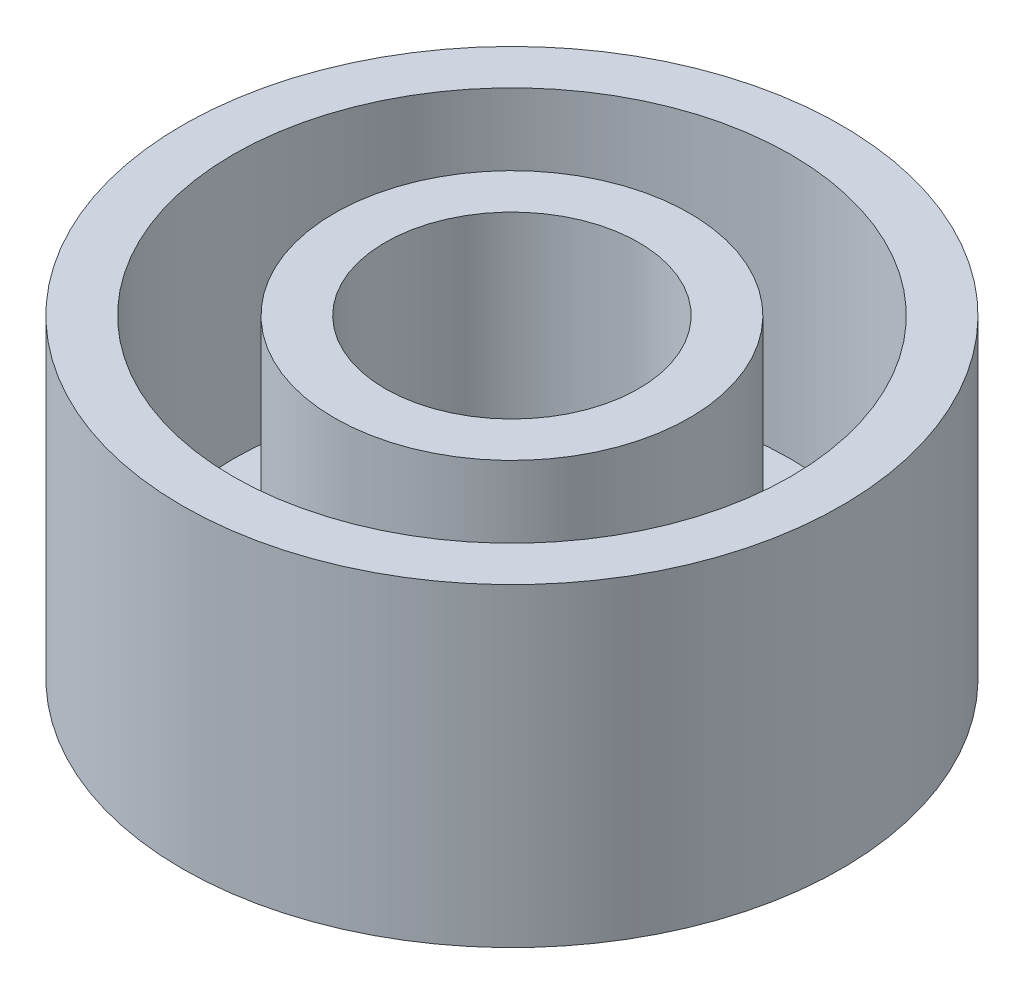
ISO-10303-21;
HEADER;
FILE_DESCRIPTION(('STEP AP214'),'2;1');
FILE_NAME('part.step','',(''),(''),'','','');
FILE_SCHEMA(('AUTOMOTIVE_DESIGN { 1 0 10303 214 1 1 1 1 }'));
ENDSEC;
DATA;
#1=APPLICATION_CONTEXT('core data for automotive mechanical design processes');
#2=APPLICATION_PROTOCOL_DEFINITION('international standard','automotive_design',2000,#1);
#3=PRODUCT_CONTEXT('',#1,'mechanical');
#4=PRODUCT('Part','Part','',(#3));
#5=PRODUCT_RELATED_PRODUCT_CATEGORY('part','',(#4));
#6=PRODUCT_DEFINITION_FORMATION('','',#4);
#7=PRODUCT_DEFINITION_CONTEXT('part definition',#1,'design');
#8=PRODUCT_DEFINITION('design','',#6,#7);
#9=PRODUCT_DEFINITION_SHAPE('','',#8);
#10=(LENGTH_UNIT() NAMED_UNIT(*) SI_UNIT(.MILLI.,.METRE.));
#11=(NAMED_UNIT(*) PLANE_ANGLE_UNIT() SI_UNIT($,.RADIAN.));
#12=(NAMED_UNIT(*) SI_UNIT($,.STERADIAN.) SOLID_ANGLE_UNIT());
#13=UNCERTAINTY_MEASURE_WITH_UNIT(LENGTH_MEASURE(1.E-05),#10,'distance_accuracy_value','');
#14=(GEOMETRIC_REPRESENTATION_CONTEXT(3) GLOBAL_UNCERTAINTY_ASSIGNED_CONTEXT((#13)) GLOBAL_UNIT_ASSIGNED_CONTEXT((#10,
#11,#12)) REPRESENTATION_CONTEXT('',''));
#15=CARTESIAN_POINT('',(0.,0.,0.));
#16=DIRECTION('',(0.,0.,1.));
#17=DIRECTION('',(1.,0.,0.));
#18=AXIS2_PLACEMENT_3D('',#15,#16,#17);
#19=CARTESIAN_POINT('',(0.,0.,0.));
#20=DIRECTION('',(0.,1.,0.));
#21=DIRECTION('',(0.,0.,1.));
#22=AXIS2_PLACEMENT_3D('',#19,#20,#21);
#23=PLANE('',#22);
#24=CARTESIAN_POINT('',(-7.24784450716205,0.,7.24784450716218));
#25=DIRECTION('',(0.,1.,0.));
#26=DIRECTION('',(0.,0.,1.));
#27=AXIS2_PLACEMENT_3D('',#24,#25,#26);
#28=CIRCLE('',#27,1.50000000000016);
#29=CARTESIAN_POINT('',(-7.24784450716205,0.,8.74784450716234));
#30=VERTEX_POINT('',#29);
#31=EDGE_CURVE('E93',#30,#30,#28,.T.);
#32=ORIENTED_EDGE('',*,*,#31,.F.);
#33=EDGE_LOOP('',(#32));
#34=FACE_BOUND('',#33,.T.);
#35=CARTESIAN_POINT('',(7.24784450716233,0.,7.2478445071619));
#36=DIRECTION('',(0.,1.,0.));
#37=DIRECTION('',(0.,0.,1.));
#38=AXIS2_PLACEMENT_3D('',#35,#36,#37);
#39=CIRCLE('',#38,1.50000000000031);
#40=CARTESIAN_POINT('',(7.24784450716233,0.,8.74784450716221));
#41=VERTEX_POINT('',#40);
#42=EDGE_CURVE('E103',#41,#41,#39,.T.);
#43=ORIENTED_EDGE('',*,*,#42,.F.);
#44=EDGE_LOOP('',(#43));
#45=FACE_BOUND('',#44,.T.);
#46=CARTESIAN_POINT('',(7.24784450716212,0.,-7.2478445071621));
#47=DIRECTION('',(0.,1.,0.));
#48=DIRECTION('',(0.,0.,1.));
#49=AXIS2_PLACEMENT_3D('',#46,#47,#48);
#50=CIRCLE('',#49,1.5);
#51=CARTESIAN_POINT('',(7.24784450716212,0.,-5.7478445071621));
#52=VERTEX_POINT('',#51);
#53=EDGE_CURVE('E107',#52,#52,#50,.T.);
#54=ORIENTED_EDGE('',*,*,#53,.F.);
#55=EDGE_LOOP('',(#54));
#56=FACE_BOUND('',#55,.T.);
#57=CARTESIAN_POINT('',(-7.24784450716213,0.,-7.2478445071621));
#58=DIRECTION('',(0.,1.,0.));
#59=DIRECTION('',(0.,0.,1.));
#60=AXIS2_PLACEMENT_3D('',#57,#58,#59);
#61=CIRCLE('',#60,1.5);
#62=CARTESIAN_POINT('',(-7.24784450716213,0.,-5.7478445071621));
#63=VERTEX_POINT('',#62);
#64=EDGE_CURVE('E111',#63,#63,#61,.T.);
#65=ORIENTED_EDGE('',*,*,#64,.F.);
#66=EDGE_LOOP('',(#65));
#67=FACE_BOUND('',#66,.T.);
#68=CARTESIAN_POINT('',(0.,0.,0.));
#69=DIRECTION('',(0.,1.,0.));
#70=DIRECTION('',(0.,0.,1.));
#71=AXIS2_PLACEMENT_3D('',#68,#69,#70);
#72=CIRCLE('',#71,8.);
#73=CARTESIAN_POINT('',(0.,0.,8.));
#74=VERTEX_POINT('',#73);
#75=EDGE_CURVE('E81',#74,#74,#72,.T.);
#76=ORIENTED_EDGE('',*,*,#75,.F.);
#77=EDGE_LOOP('',(#76));
#78=FACE_BOUND('',#77,.T.);
#79=CARTESIAN_POINT('',(0.,0.,0.));
#80=DIRECTION('',(0.,1.,0.));
#81=DIRECTION('',(0.,0.,1.));
#82=AXIS2_PLACEMENT_3D('',#79,#80,#81);
#83=CIRCLE('',#82,12.5);
#84=CARTESIAN_POINT('',(0.,0.,12.5));
#85=VERTEX_POINT('',#84);
#86=EDGE_CURVE('E11',#85,#85,#83,.F.);
#87=ORIENTED_EDGE('',*,*,#86,.F.);
#88=EDGE_LOOP('',(#87));
#89=FACE_BOUND('',#88,.T.);
#90=ADVANCED_FACE('F47',(#34,#45,#56,#67,#78,#89),#23,.T.);
#91=CARTESIAN_POINT('',(0.,26.,0.));
#92=DIRECTION('',(0.,-1.,0.));
#93=DIRECTION('',(0.,0.,-1.));
#94=AXIS2_PLACEMENT_3D('',#91,#92,#93);
#95=CYLINDRICAL_SURFACE('',#94,27.5);
#96=CARTESIAN_POINT('',(0.,26.,0.));
#97=DIRECTION('',(0.,1.,0.));
#98=DIRECTION('',(0.,0.,1.));
#99=AXIS2_PLACEMENT_3D('',#96,#97,#98);
#100=CIRCLE('',#99,27.5);
#101=CARTESIAN_POINT('',(0.,26.,27.5));
#102=VERTEX_POINT('',#101);
#103=EDGE_CURVE('E60',#102,#102,#100,.T.);
#104=ORIENTED_EDGE('',*,*,#103,.T.);
#105=EDGE_LOOP('',(#104));
#106=FACE_BOUND('',#105,.T.);
#107=CARTESIAN_POINT('',(0.,0.,0.));
#108=DIRECTION('',(0.,1.,0.));
#109=DIRECTION('',(0.,0.,1.));
#110=AXIS2_PLACEMENT_3D('',#107,#108,#109);
#111=CIRCLE('',#110,27.5);
#112=CARTESIAN_POINT('',(0.,0.,27.5));
#113=VERTEX_POINT('',#112);
#114=EDGE_CURVE('E66',#113,#113,#111,.T.);
#115=ORIENTED_EDGE('',*,*,#114,.F.);
#116=EDGE_LOOP('',(#115));
#117=FACE_BOUND('',#116,.T.);
#118=ADVANCED_FACE('F49',(#106,#117),#95,.F.);
#119=CARTESIAN_POINT('',(0.,26.,0.));
#120=DIRECTION('',(0.,-1.,0.));
#121=DIRECTION('',(0.,0.,-1.));
#122=AXIS2_PLACEMENT_3D('',#119,#120,#121);
#123=CYLINDRICAL_SURFACE('',#122,32.5);
#124=CARTESIAN_POINT('',(0.,26.,0.));
#125=DIRECTION('',(0.,1.,0.));
#126=DIRECTION('',(0.,0.,1.));
#127=AXIS2_PLACEMENT_3D('',#124,#125,#126);
#128=CIRCLE('',#127,32.5);
#129=CARTESIAN_POINT('',(0.,26.,32.5));
#130=VERTEX_POINT('',#129);
#131=EDGE_CURVE('E55',#130,#130,#128,.T.);
#132=ORIENTED_EDGE('',*,*,#131,.F.);
#133=EDGE_LOOP('',(#132));
#134=FACE_BOUND('',#133,.T.);
#135=CARTESIAN_POINT('',(0.,-5.,0.));
#136=DIRECTION('',(0.,1.,0.));
#137=DIRECTION('',(0.,0.,1.));
#138=AXIS2_PLACEMENT_3D('',#135,#136,#137);
#139=CIRCLE('',#138,32.5);
#140=CARTESIAN_POINT('',(0.,-5.,32.5));
#141=VERTEX_POINT('',#140);
#142=EDGE_CURVE('E71',#141,#141,#139,.T.);
#143=ORIENTED_EDGE('',*,*,#142,.T.);
#144=EDGE_LOOP('',(#143));
#145=FACE_BOUND('',#144,.T.);
#146=ADVANCED_FACE('F158',(#134,#145),#123,.T.);
#147=CARTESIAN_POINT('',(0.,26.,0.));
#148=DIRECTION('',(0.,1.,0.));
#149=DIRECTION('',(0.,0.,1.));
#150=AXIS2_PLACEMENT_3D('',#147,#148,#149);
#151=PLANE('',#150);
#152=ORIENTED_EDGE('',*,*,#103,.F.);
#153=EDGE_LOOP('',(#152));
#154=FACE_BOUND('',#153,.T.);
#155=ORIENTED_EDGE('',*,*,#131,.T.);
#156=EDGE_LOOP('',(#155));
#157=FACE_BOUND('',#156,.T.);
#158=ADVANCED_FACE('F165',(#154,#157),#151,.T.);
#159=CARTESIAN_POINT('',(0.,0.,0.));
#160=DIRECTION('',(0.,1.,0.));
#161=DIRECTION('',(0.,0.,1.));
#162=AXIS2_PLACEMENT_3D('',#159,#160,#161);
#163=CIRCLE('',#162,17.5);
#164=CARTESIAN_POINT('',(0.,0.,17.5));
#165=VERTEX_POINT('',#164);
#166=EDGE_CURVE('E88',#165,#165,#163,.T.);
#167=ORIENTED_EDGE('',*,*,#166,.F.);
#168=EDGE_LOOP('',(#167));
#169=FACE_BOUND('',#168,.T.);
#170=ORIENTED_EDGE('',*,*,#114,.T.);
#171=EDGE_LOOP('',(#170));
#172=FACE_BOUND('',#171,.T.);
#173=ADVANCED_FACE('F154',(#169,#172),#23,.T.);
#174=CARTESIAN_POINT('',(0.,-5.,0.));
#175=DIRECTION('',(0.,1.,0.));
#176=DIRECTION('',(0.,0.,1.));
#177=AXIS2_PLACEMENT_3D('',#174,#175,#176);
#178=PLANE('',#177);
#179=CARTESIAN_POINT('',(-7.24784450716205,-5.,7.24784450716218));
#180=DIRECTION('',(0.,1.,0.));
#181=DIRECTION('',(0.,0.,1.));
#182=AXIS2_PLACEMENT_3D('',#179,#180,#181);
#183=CIRCLE('',#182,1.50000000000016);
#184=CARTESIAN_POINT('',(-7.24784450716205,-5.,8.74784450716234));
#185=VERTEX_POINT('',#184);
#186=EDGE_CURVE('E120',#185,#185,#183,.T.);
#187=ORIENTED_EDGE('',*,*,#186,.T.);
#188=EDGE_LOOP('',(#187));
#189=FACE_BOUND('',#188,.T.);
#190=CARTESIAN_POINT('',(7.24784450716233,-5.,7.2478445071619));
#191=DIRECTION('',(0.,1.,0.));
#192=DIRECTION('',(0.,0.,1.));
#193=AXIS2_PLACEMENT_3D('',#190,#191,#192);
#194=CIRCLE('',#193,1.50000000000031);
#195=CARTESIAN_POINT('',(7.24784450716233,-5.,8.74784450716221));
#196=VERTEX_POINT('',#195);
#197=EDGE_CURVE('E124',#196,#196,#194,.T.);
#198=ORIENTED_EDGE('',*,*,#197,.T.);
#199=EDGE_LOOP('',(#198));
#200=FACE_BOUND('',#199,.T.);
#201=CARTESIAN_POINT('',(7.24784450716212,-5.,-7.2478445071621));
#202=DIRECTION('',(0.,1.,0.));
#203=DIRECTION('',(0.,0.,1.));
#204=AXIS2_PLACEMENT_3D('',#201,#202,#203);
#205=CIRCLE('',#204,1.5);
#206=CARTESIAN_POINT('',(7.24784450716212,-5.,-5.7478445071621));
#207=VERTEX_POINT('',#206);
#208=EDGE_CURVE('E119',#207,#207,#205,.T.);
#209=ORIENTED_EDGE('',*,*,#208,.T.);
#210=EDGE_LOOP('',(#209));
#211=FACE_BOUND('',#210,.T.);
#212=CARTESIAN_POINT('',(-7.24784450716213,-5.,-7.2478445071621));
#213=DIRECTION('',(0.,1.,0.));
#214=DIRECTION('',(0.,0.,1.));
#215=AXIS2_PLACEMENT_3D('',#212,#213,#214);
#216=CIRCLE('',#215,1.5);
#217=CARTESIAN_POINT('',(-7.24784450716213,-5.,-5.7478445071621));
#218=VERTEX_POINT('',#217);
#219=EDGE_CURVE('E115',#218,#218,#216,.T.);
#220=ORIENTED_EDGE('',*,*,#219,.T.);
#221=EDGE_LOOP('',(#220));
#222=FACE_BOUND('',#221,.T.);
#223=CARTESIAN_POINT('',(0.,-5.,0.));
#224=DIRECTION('',(0.,1.,0.));
#225=DIRECTION('',(0.,0.,1.));
#226=AXIS2_PLACEMENT_3D('',#223,#224,#225);
#227=CIRCLE('',#226,8.);
#228=CARTESIAN_POINT('',(0.,-5.,8.));
#229=VERTEX_POINT('',#228);
#230=EDGE_CURVE('E76',#229,#229,#227,.T.);
#231=ORIENTED_EDGE('',*,*,#230,.T.);
#232=EDGE_LOOP('',(#231));
#233=FACE_BOUND('',#232,.T.);
#234=ORIENTED_EDGE('',*,*,#142,.F.);
#235=EDGE_LOOP('',(#234));
#236=FACE_BOUND('',#235,.T.);
#237=ADVANCED_FACE('F132',(#189,#200,#211,#222,#233,#236),#178,.F.);
#238=CARTESIAN_POINT('',(0.,-5.,0.));
#239=DIRECTION('',(0.,1.,0.));
#240=DIRECTION('',(0.,0.,1.));
#241=AXIS2_PLACEMENT_3D('',#238,#239,#240);
#242=CYLINDRICAL_SURFACE('',#241,8.);
#243=ORIENTED_EDGE('',*,*,#230,.F.);
#244=EDGE_LOOP('',(#243));
#245=FACE_BOUND('',#244,.T.);
#246=ORIENTED_EDGE('',*,*,#75,.T.);
#247=EDGE_LOOP('',(#246));
#248=FACE_BOUND('',#247,.T.);
#249=ADVANCED_FACE('F171',(#245,#248),#242,.F.);
#250=CARTESIAN_POINT('',(0.,26.,0.));
#251=DIRECTION('',(0.,-1.,0.));
#252=DIRECTION('',(0.,0.,-1.));
#253=AXIS2_PLACEMENT_3D('',#250,#251,#252);
#254=CYLINDRICAL_SURFACE('',#253,12.5);
#255=CARTESIAN_POINT('',(0.,26.,0.));
#256=DIRECTION('',(0.,1.,0.));
#257=DIRECTION('',(0.,0.,1.));
#258=AXIS2_PLACEMENT_3D('',#255,#256,#257);
#259=CIRCLE('',#258,12.5);
#260=CARTESIAN_POINT('',(0.,26.,12.5));
#261=VERTEX_POINT('',#260);
#262=EDGE_CURVE('E92',#261,#261,#259,.T.);
#263=ORIENTED_EDGE('',*,*,#262,.T.);
#264=EDGE_LOOP('',(#263));
#265=FACE_BOUND('',#264,.T.);
#266=ORIENTED_EDGE('',*,*,#86,.T.);
#267=EDGE_LOOP('',(#266));
#268=FACE_BOUND('',#267,.T.);
#269=ADVANCED_FACE('F178',(#265,#268),#254,.F.);
#270=CARTESIAN_POINT('',(0.,26.,0.));
#271=DIRECTION('',(0.,-1.,0.));
#272=DIRECTION('',(0.,0.,-1.));
#273=AXIS2_PLACEMENT_3D('',#270,#271,#272);
#274=CYLINDRICAL_SURFACE('',#273,17.5);
#275=CARTESIAN_POINT('',(0.,26.,0.));
#276=DIRECTION('',(0.,1.,0.));
#277=DIRECTION('',(0.,0.,1.));
#278=AXIS2_PLACEMENT_3D('',#275,#276,#277);
#279=CIRCLE('',#278,17.5);
#280=CARTESIAN_POINT('',(0.,26.,17.5));
#281=VERTEX_POINT('',#280);
#282=EDGE_CURVE('E86',#281,#281,#279,.T.);
#283=ORIENTED_EDGE('',*,*,#282,.F.);
#284=EDGE_LOOP('',(#283));
#285=FACE_BOUND('',#284,.T.);
#286=ORIENTED_EDGE('',*,*,#166,.T.);
#287=EDGE_LOOP('',(#286));
#288=FACE_BOUND('',#287,.T.);
#289=ADVANCED_FACE('F176',(#285,#288),#274,.T.);
#290=CARTESIAN_POINT('',(0.,26.,0.));
#291=DIRECTION('',(0.,1.,0.));
#292=DIRECTION('',(0.,0.,1.));
#293=AXIS2_PLACEMENT_3D('',#290,#291,#292);
#294=PLANE('',#293);
#295=ORIENTED_EDGE('',*,*,#262,.F.);
#296=EDGE_LOOP('',(#295));
#297=FACE_BOUND('',#296,.T.);
#298=ORIENTED_EDGE('',*,*,#282,.T.);
#299=EDGE_LOOP('',(#298));
#300=FACE_BOUND('',#299,.T.);
#301=ADVANCED_FACE('F148',(#297,#300),#294,.T.);
#302=CARTESIAN_POINT('',(-7.24784450716213,-5.,-7.2478445071621));
#303=DIRECTION('',(0.,1.,0.));
#304=DIRECTION('',(0.,0.,1.));
#305=AXIS2_PLACEMENT_3D('',#302,#303,#304);
#306=CYLINDRICAL_SURFACE('',#305,1.5);
#307=ORIENTED_EDGE('',*,*,#64,.T.);
#308=EDGE_LOOP('',(#307));
#309=FACE_BOUND('',#308,.T.);
#310=ORIENTED_EDGE('',*,*,#219,.F.);
#311=EDGE_LOOP('',(#310));
#312=FACE_BOUND('',#311,.T.);
#313=ADVANCED_FACE('F138',(#309,#312),#306,.F.);
#314=CARTESIAN_POINT('',(7.24784450716212,-5.,-7.2478445071621));
#315=DIRECTION('',(0.,1.,0.));
#316=DIRECTION('',(0.,0.,1.));
#317=AXIS2_PLACEMENT_3D('',#314,#315,#316);
#318=CYLINDRICAL_SURFACE('',#317,1.5);
#319=ORIENTED_EDGE('',*,*,#53,.T.);
#320=EDGE_LOOP('',(#319));
#321=FACE_BOUND('',#320,.T.);
#322=ORIENTED_EDGE('',*,*,#208,.F.);
#323=EDGE_LOOP('',(#322));
#324=FACE_BOUND('',#323,.T.);
#325=ADVANCED_FACE('F135',(#321,#324),#318,.F.);
#326=CARTESIAN_POINT('',(7.24784450716233,-5.,7.2478445071619));
#327=DIRECTION('',(0.,1.,0.));
#328=DIRECTION('',(0.,0.,1.));
#329=AXIS2_PLACEMENT_3D('',#326,#327,#328);
#330=CYLINDRICAL_SURFACE('',#329,1.50000000000031);
#331=ORIENTED_EDGE('',*,*,#42,.T.);
#332=EDGE_LOOP('',(#331));
#333=FACE_BOUND('',#332,.T.);
#334=ORIENTED_EDGE('',*,*,#197,.F.);
#335=EDGE_LOOP('',(#334));
#336=FACE_BOUND('',#335,.T.);
#337=ADVANCED_FACE('F137',(#333,#336),#330,.F.);
#338=CARTESIAN_POINT('',(-7.24784450716205,-5.,7.24784450716218));
#339=DIRECTION('',(0.,1.,0.));
#340=DIRECTION('',(0.,0.,1.));
#341=AXIS2_PLACEMENT_3D('',#338,#339,#340);
#342=CYLINDRICAL_SURFACE('',#341,1.50000000000016);
#343=ORIENTED_EDGE('',*,*,#31,.T.);
#344=EDGE_LOOP('',(#343));
#345=FACE_BOUND('',#344,.T.);
#346=ORIENTED_EDGE('',*,*,#186,.F.);
#347=EDGE_LOOP('',(#346));
#348=FACE_BOUND('',#347,.T.);
#349=ADVANCED_FACE('F145',(#345,#348),#342,.F.);
#350=CLOSED_SHELL('',(#90,#118,#146,#158,#173,#237,#249,#269,#289,#301,#313,#325,#337,#349));
#351=MANIFOLD_SOLID_BREP('B2',#350);
#352=ADVANCED_BREP_SHAPE_REPRESENTATION('',(#18,#351),#14);
#353=SHAPE_DEFINITION_REPRESENTATION(#9,#352);
ENDSEC;
END-ISO-10303-21;
